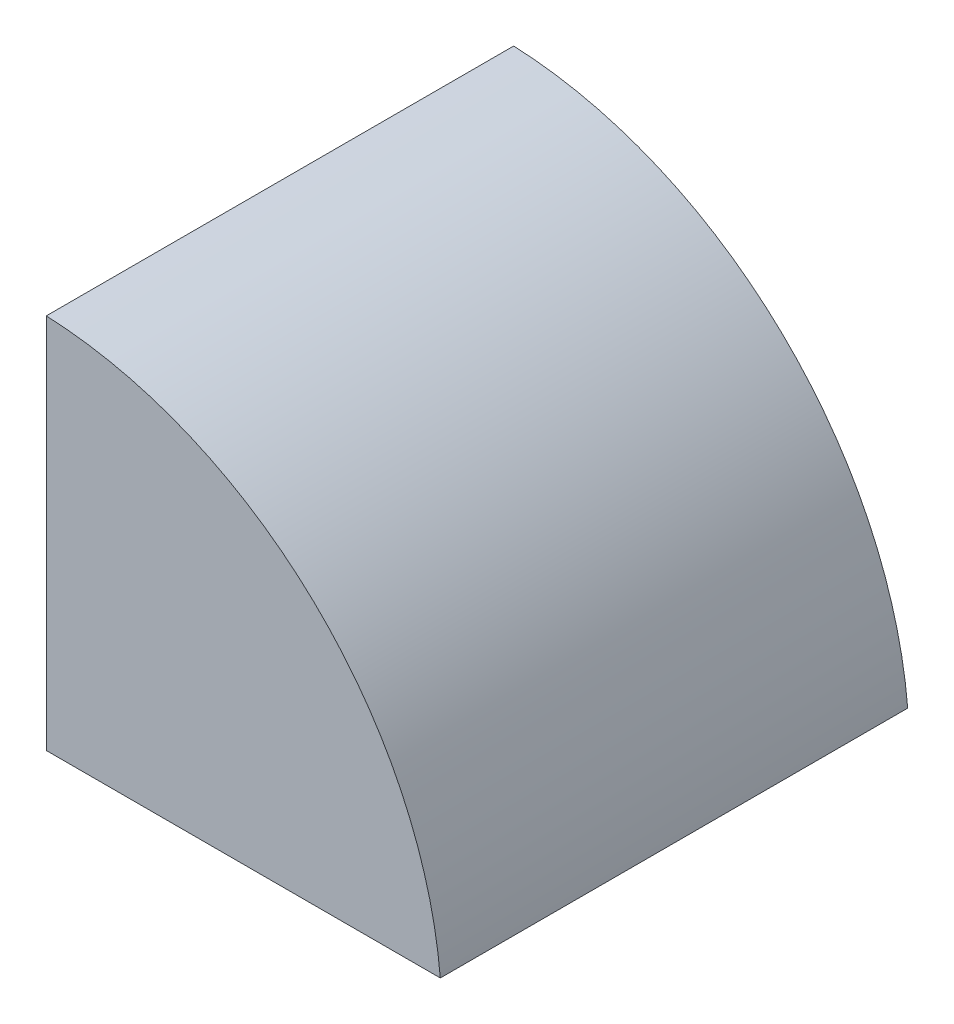
ISO-10303-21;
HEADER;
FILE_DESCRIPTION(('STEP AP214'),'2;1');
FILE_NAME('part.step','',(''),(''),'','','');
FILE_SCHEMA(('AUTOMOTIVE_DESIGN { 1 0 10303 214 1 1 1 1 }'));
ENDSEC;
DATA;
#1=APPLICATION_CONTEXT('core data for automotive mechanical design processes');
#2=APPLICATION_PROTOCOL_DEFINITION('international standard','automotive_design',2000,#1);
#3=PRODUCT_CONTEXT('',#1,'mechanical');
#4=PRODUCT('Part','Part','',(#3));
#5=PRODUCT_RELATED_PRODUCT_CATEGORY('part','',(#4));
#6=PRODUCT_DEFINITION_FORMATION('','',#4);
#7=PRODUCT_DEFINITION_CONTEXT('part definition',#1,'design');
#8=PRODUCT_DEFINITION('design','',#6,#7);
#9=PRODUCT_DEFINITION_SHAPE('','',#8);
#10=(LENGTH_UNIT() NAMED_UNIT(*) SI_UNIT(.MILLI.,.METRE.));
#11=(NAMED_UNIT(*) PLANE_ANGLE_UNIT() SI_UNIT($,.RADIAN.));
#12=(NAMED_UNIT(*) SI_UNIT($,.STERADIAN.) SOLID_ANGLE_UNIT());
#13=UNCERTAINTY_MEASURE_WITH_UNIT(LENGTH_MEASURE(1.E-05),#10,'distance_accuracy_value','');
#14=(GEOMETRIC_REPRESENTATION_CONTEXT(3) GLOBAL_UNCERTAINTY_ASSIGNED_CONTEXT((#13)) GLOBAL_UNIT_ASSIGNED_CONTEXT((#10,
#11,#12)) REPRESENTATION_CONTEXT('',''));
#15=CARTESIAN_POINT('',(0.,0.,0.));
#16=DIRECTION('',(0.,0.,1.));
#17=DIRECTION('',(1.,0.,0.));
#18=AXIS2_PLACEMENT_3D('',#15,#16,#17);
#19=CARTESIAN_POINT('',(1.14916221140002,2.35763283939434,30.));
#20=DIRECTION('',(1.,0.,0.));
#21=DIRECTION('',(0.,0.,-1.));
#22=AXIS2_PLACEMENT_3D('',#19,#20,#21);
#23=PLANE('',#22);
#24=DIRECTION('',(0.,-1.,0.));
#25=VECTOR('',#24,1.);
#26=CARTESIAN_POINT('',(1.14916221140002,2.35763283939434,0.));
#27=LINE('',#26,#25);
#28=CARTESIAN_POINT('',(1.14916221140002,26.5192147003751,0.));
#29=VERTEX_POINT('',#28);
#30=CARTESIAN_POINT('',(1.14916221140002,2.35763283939434,0.));
#31=VERTEX_POINT('',#30);
#32=EDGE_CURVE('E82',#29,#31,#27,.T.);
#33=ORIENTED_EDGE('',*,*,#32,.T.);
#34=DIRECTION('',(0.,0.,-1.));
#35=VECTOR('',#34,1.);
#36=CARTESIAN_POINT('',(1.14916221140002,2.35763283939434,30.));
#37=LINE('',#36,#35);
#38=CARTESIAN_POINT('',(1.14916221140002,2.35763283939434,30.));
#39=VERTEX_POINT('',#38);
#40=EDGE_CURVE('E11',#39,#31,#37,.T.);
#41=ORIENTED_EDGE('',*,*,#40,.F.);
#42=DIRECTION('',(0.,-1.,0.));
#43=VECTOR('',#42,1.);
#44=CARTESIAN_POINT('',(1.14916221140002,2.35763283939434,30.));
#45=LINE('',#44,#43);
#46=CARTESIAN_POINT('',(1.14916221140002,26.5192147003751,30.));
#47=VERTEX_POINT('',#46);
#48=EDGE_CURVE('E75',#47,#39,#45,.T.);
#49=ORIENTED_EDGE('',*,*,#48,.F.);
#50=DIRECTION('',(0.,0.,-1.));
#51=VECTOR('',#50,1.);
#52=CARTESIAN_POINT('',(1.14916221140002,26.5192147003751,30.));
#53=LINE('',#52,#51);
#54=EDGE_CURVE('E83',#47,#29,#53,.T.);
#55=ORIENTED_EDGE('',*,*,#54,.T.);
#56=EDGE_LOOP('',(#33,#41,#49,#55));
#57=FACE_BOUND('',#56,.T.);
#58=ADVANCED_FACE('F35',(#57),#23,.F.);
#59=CARTESIAN_POINT('',(1.14916221140002,2.35763283939434,30.));
#60=DIRECTION('',(0.,1.,0.));
#61=DIRECTION('',(0.,0.,1.));
#62=AXIS2_PLACEMENT_3D('',#59,#60,#61);
#63=PLANE('',#62);
#64=DIRECTION('',(1.,0.,0.));
#65=VECTOR('',#64,1.);
#66=CARTESIAN_POINT('',(1.14916221140002,2.35763283939434,0.));
#67=LINE('',#66,#65);
#68=CARTESIAN_POINT('',(26.4391923005849,2.35763283939434,0.));
#69=VERTEX_POINT('',#68);
#70=EDGE_CURVE('E63',#31,#69,#67,.T.);
#71=ORIENTED_EDGE('',*,*,#70,.T.);
#72=DIRECTION('',(0.,0.,-1.));
#73=VECTOR('',#72,1.);
#74=CARTESIAN_POINT('',(26.4391923005849,2.35763283939434,30.));
#75=LINE('',#74,#73);
#76=CARTESIAN_POINT('',(26.4391923005849,2.35763283939434,30.));
#77=VERTEX_POINT('',#76);
#78=EDGE_CURVE('E43',#77,#69,#75,.T.);
#79=ORIENTED_EDGE('',*,*,#78,.F.);
#80=DIRECTION('',(1.,0.,0.));
#81=VECTOR('',#80,1.);
#82=CARTESIAN_POINT('',(1.14916221140002,2.35763283939434,30.));
#83=LINE('',#82,#81);
#84=EDGE_CURVE('E71',#39,#77,#83,.T.);
#85=ORIENTED_EDGE('',*,*,#84,.F.);
#86=ORIENTED_EDGE('',*,*,#40,.T.);
#87=EDGE_LOOP('',(#71,#79,#85,#86));
#88=FACE_BOUND('',#87,.T.);
#89=ADVANCED_FACE('F72',(#88),#63,.F.);
#90=CARTESIAN_POINT('',(0.,0.,30.));
#91=DIRECTION('',(0.,0.,-1.));
#92=DIRECTION('',(-1.,0.,0.));
#93=AXIS2_PLACEMENT_3D('',#90,#91,#92);
#94=CYLINDRICAL_SURFACE('',#93,26.5441014561182);
#95=CARTESIAN_POINT('',(0.,0.,0.));
#96=DIRECTION('',(0.,0.,1.));
#97=DIRECTION('',(1.,0.,0.));
#98=AXIS2_PLACEMENT_3D('',#95,#96,#97);
#99=CIRCLE('',#98,26.5441014561182);
#100=EDGE_CURVE('E68',#69,#29,#99,.T.);
#101=ORIENTED_EDGE('',*,*,#100,.T.);
#102=ORIENTED_EDGE('',*,*,#54,.F.);
#103=CARTESIAN_POINT('',(0.,0.,30.));
#104=DIRECTION('',(0.,0.,1.));
#105=DIRECTION('',(1.,0.,0.));
#106=AXIS2_PLACEMENT_3D('',#103,#104,#105);
#107=CIRCLE('',#106,26.5441014561182);
#108=EDGE_CURVE('E51',#77,#47,#107,.T.);
#109=ORIENTED_EDGE('',*,*,#108,.F.);
#110=ORIENTED_EDGE('',*,*,#78,.T.);
#111=EDGE_LOOP('',(#101,#102,#109,#110));
#112=FACE_BOUND('',#111,.T.);
#113=ADVANCED_FACE('F90',(#112),#94,.T.);
#114=CARTESIAN_POINT('',(0.,0.,30.));
#115=DIRECTION('',(0.,0.,1.));
#116=DIRECTION('',(1.,0.,0.));
#117=AXIS2_PLACEMENT_3D('',#114,#115,#116);
#118=PLANE('',#117);
#119=ORIENTED_EDGE('',*,*,#48,.T.);
#120=ORIENTED_EDGE('',*,*,#84,.T.);
#121=ORIENTED_EDGE('',*,*,#108,.T.);
#122=EDGE_LOOP('',(#119,#120,#121));
#123=FACE_BOUND('',#122,.T.);
#124=ADVANCED_FACE('F78',(#123),#118,.T.);
#125=CARTESIAN_POINT('',(0.,0.,0.));
#126=DIRECTION('',(0.,0.,1.));
#127=DIRECTION('',(1.,0.,0.));
#128=AXIS2_PLACEMENT_3D('',#125,#126,#127);
#129=PLANE('',#128);
#130=ORIENTED_EDGE('',*,*,#32,.F.);
#131=ORIENTED_EDGE('',*,*,#100,.F.);
#132=ORIENTED_EDGE('',*,*,#70,.F.);
#133=EDGE_LOOP('',(#130,#131,#132));
#134=FACE_BOUND('',#133,.T.);
#135=ADVANCED_FACE('F91',(#134),#129,.F.);
#136=CLOSED_SHELL('',(#58,#89,#113,#124,#135));
#137=MANIFOLD_SOLID_BREP('B2',#136);
#138=ADVANCED_BREP_SHAPE_REPRESENTATION('',(#18,#137),#14);
#139=SHAPE_DEFINITION_REPRESENTATION(#9,#138);
ENDSEC;
END-ISO-10303-21;
